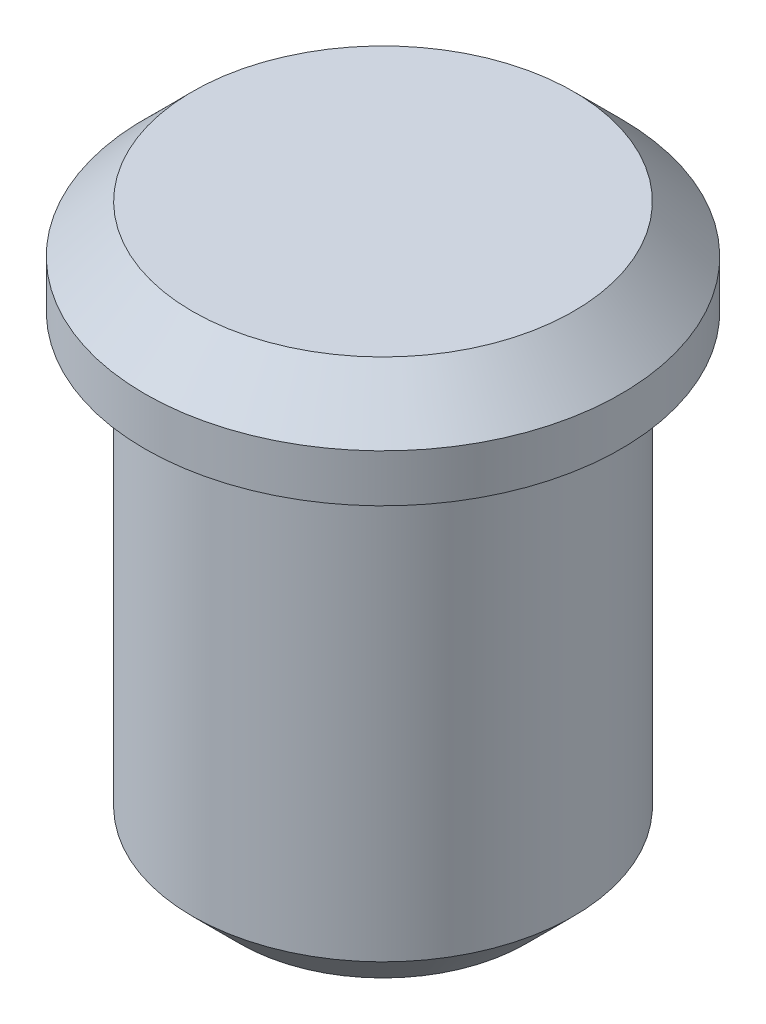
ISO-10303-21;
HEADER;
FILE_DESCRIPTION(('STEP AP214'),'2;1');
FILE_NAME('part.step','',(''),(''),'','','');
FILE_SCHEMA(('AUTOMOTIVE_DESIGN { 1 0 10303 214 1 1 1 1 }'));
ENDSEC;
DATA;
#1=APPLICATION_CONTEXT('core data for automotive mechanical design processes');
#2=APPLICATION_PROTOCOL_DEFINITION('international standard','automotive_design',2000,#1);
#3=PRODUCT_CONTEXT('',#1,'mechanical');
#4=PRODUCT('Part','Part','',(#3));
#5=PRODUCT_RELATED_PRODUCT_CATEGORY('part','',(#4));
#6=PRODUCT_DEFINITION_FORMATION('','',#4);
#7=PRODUCT_DEFINITION_CONTEXT('part definition',#1,'design');
#8=PRODUCT_DEFINITION('design','',#6,#7);
#9=PRODUCT_DEFINITION_SHAPE('','',#8);
#10=(LENGTH_UNIT() NAMED_UNIT(*) SI_UNIT(.MILLI.,.METRE.));
#11=(NAMED_UNIT(*) PLANE_ANGLE_UNIT() SI_UNIT($,.RADIAN.));
#12=(NAMED_UNIT(*) SI_UNIT($,.STERADIAN.) SOLID_ANGLE_UNIT());
#13=UNCERTAINTY_MEASURE_WITH_UNIT(LENGTH_MEASURE(1.E-05),#10,'distance_accuracy_value','');
#14=(GEOMETRIC_REPRESENTATION_CONTEXT(3) GLOBAL_UNCERTAINTY_ASSIGNED_CONTEXT((#13)) GLOBAL_UNIT_ASSIGNED_CONTEXT((#10,
#11,#12)) REPRESENTATION_CONTEXT('',''));
#15=CARTESIAN_POINT('',(0.,0.,0.));
#16=DIRECTION('',(0.,0.,1.));
#17=DIRECTION('',(1.,0.,0.));
#18=AXIS2_PLACEMENT_3D('',#15,#16,#17);
#19=CARTESIAN_POINT('',(0.,-10.,0.));
#20=DIRECTION('',(0.,1.,0.));
#21=DIRECTION('',(0.,0.,1.));
#22=AXIS2_PLACEMENT_3D('',#19,#20,#21);
#23=CYLINDRICAL_SURFACE('',#22,4.);
#24=CARTESIAN_POINT('',(0.,-9.,0.));
#25=DIRECTION('',(0.,1.,0.));
#26=DIRECTION('',(0.,0.,1.));
#27=AXIS2_PLACEMENT_3D('',#24,#25,#26);
#28=CIRCLE('',#27,4.);
#29=CARTESIAN_POINT('',(0.,-9.,4.));
#30=VERTEX_POINT('',#29);
#31=EDGE_CURVE('E45',#30,#30,#28,.T.);
#32=ORIENTED_EDGE('',*,*,#31,.T.);
#33=EDGE_LOOP('',(#32));
#34=FACE_BOUND('',#33,.T.);
#35=CARTESIAN_POINT('',(0.,0.,0.));
#36=DIRECTION('',(0.,1.,0.));
#37=DIRECTION('',(0.,0.,1.));
#38=AXIS2_PLACEMENT_3D('',#35,#36,#37);
#39=CIRCLE('',#38,4.);
#40=CARTESIAN_POINT('',(0.,0.,4.));
#41=VERTEX_POINT('',#40);
#42=EDGE_CURVE('E50',#41,#41,#39,.T.);
#43=ORIENTED_EDGE('',*,*,#42,.F.);
#44=EDGE_LOOP('',(#43));
#45=FACE_BOUND('',#44,.T.);
#46=ADVANCED_FACE('F30',(#34,#45),#23,.T.);
#47=CARTESIAN_POINT('',(0.,-10.,0.));
#48=DIRECTION('',(0.,1.,0.));
#49=DIRECTION('',(0.,0.,1.));
#50=AXIS2_PLACEMENT_3D('',#47,#48,#49);
#51=PLANE('',#50);
#52=CARTESIAN_POINT('',(0.,-10.,0.));
#53=DIRECTION('',(0.,1.,0.));
#54=DIRECTION('',(0.,0.,1.));
#55=AXIS2_PLACEMENT_3D('',#52,#53,#54);
#56=CIRCLE('',#55,3.);
#57=CARTESIAN_POINT('',(0.,-10.,3.));
#58=VERTEX_POINT('',#57);
#59=EDGE_CURVE('E41',#58,#58,#56,.F.);
#60=ORIENTED_EDGE('',*,*,#59,.T.);
#61=EDGE_LOOP('',(#60));
#62=FACE_BOUND('',#61,.T.);
#63=ADVANCED_FACE('F73',(#62),#51,.F.);
#64=CARTESIAN_POINT('',(0.,2.,0.));
#65=DIRECTION('',(0.,-1.,0.));
#66=DIRECTION('',(0.,0.,-1.));
#67=AXIS2_PLACEMENT_3D('',#64,#65,#66);
#68=CYLINDRICAL_SURFACE('',#67,5.);
#69=CARTESIAN_POINT('',(0.,1.,0.));
#70=DIRECTION('',(0.,1.,0.));
#71=DIRECTION('',(0.,0.,1.));
#72=AXIS2_PLACEMENT_3D('',#69,#70,#71);
#73=CIRCLE('',#72,5.);
#74=CARTESIAN_POINT('',(0.,1.,5.));
#75=VERTEX_POINT('',#74);
#76=EDGE_CURVE('E10',#75,#75,#73,.F.);
#77=ORIENTED_EDGE('',*,*,#76,.T.);
#78=EDGE_LOOP('',(#77));
#79=FACE_BOUND('',#78,.T.);
#80=CARTESIAN_POINT('',(0.,0.,0.));
#81=DIRECTION('',(0.,1.,0.));
#82=DIRECTION('',(0.,0.,1.));
#83=AXIS2_PLACEMENT_3D('',#80,#81,#82);
#84=CIRCLE('',#83,5.);
#85=CARTESIAN_POINT('',(0.,0.,5.));
#86=VERTEX_POINT('',#85);
#87=EDGE_CURVE('E53',#86,#86,#84,.T.);
#88=ORIENTED_EDGE('',*,*,#87,.T.);
#89=EDGE_LOOP('',(#88));
#90=FACE_BOUND('',#89,.T.);
#91=ADVANCED_FACE('F57',(#79,#90),#68,.T.);
#92=CARTESIAN_POINT('',(0.,2.,0.));
#93=DIRECTION('',(0.,1.,0.));
#94=DIRECTION('',(0.,0.,1.));
#95=AXIS2_PLACEMENT_3D('',#92,#93,#94);
#96=PLANE('',#95);
#97=CARTESIAN_POINT('',(0.,2.,0.));
#98=DIRECTION('',(0.,1.,0.));
#99=DIRECTION('',(0.,0.,1.));
#100=AXIS2_PLACEMENT_3D('',#97,#98,#99);
#101=CIRCLE('',#100,4.);
#102=CARTESIAN_POINT('',(0.,2.,4.));
#103=VERTEX_POINT('',#102);
#104=EDGE_CURVE('E37',#103,#103,#101,.T.);
#105=ORIENTED_EDGE('',*,*,#104,.T.);
#106=EDGE_LOOP('',(#105));
#107=FACE_BOUND('',#106,.T.);
#108=ADVANCED_FACE('F62',(#107),#96,.T.);
#109=CARTESIAN_POINT('',(0.,0.,0.));
#110=DIRECTION('',(0.,1.,0.));
#111=DIRECTION('',(0.,0.,1.));
#112=AXIS2_PLACEMENT_3D('',#109,#110,#111);
#113=PLANE('',#112);
#114=ORIENTED_EDGE('',*,*,#42,.T.);
#115=EDGE_LOOP('',(#114));
#116=FACE_BOUND('',#115,.T.);
#117=ORIENTED_EDGE('',*,*,#87,.F.);
#118=EDGE_LOOP('',(#117));
#119=FACE_BOUND('',#118,.T.);
#120=ADVANCED_FACE('F59',(#116,#119),#113,.F.);
#121=CARTESIAN_POINT('',(0.,-9.,0.));
#122=DIRECTION('',(0.,1.,0.));
#123=DIRECTION('',(0.,0.,1.));
#124=AXIS2_PLACEMENT_3D('',#121,#122,#123);
#125=CONICAL_SURFACE('',#124,4.,0.78539816339745);
#126=ORIENTED_EDGE('',*,*,#59,.F.);
#127=EDGE_LOOP('',(#126));
#128=FACE_BOUND('',#127,.T.);
#129=ORIENTED_EDGE('',*,*,#31,.F.);
#130=EDGE_LOOP('',(#129));
#131=FACE_BOUND('',#130,.T.);
#132=ADVANCED_FACE('F61',(#128,#131),#125,.T.);
#133=CARTESIAN_POINT('',(0.,2.,0.));
#134=DIRECTION('',(0.,-1.,0.));
#135=DIRECTION('',(0.,0.,-1.));
#136=AXIS2_PLACEMENT_3D('',#133,#134,#135);
#137=CONICAL_SURFACE('',#136,4.,0.78539816339745);
#138=ORIENTED_EDGE('',*,*,#76,.F.);
#139=EDGE_LOOP('',(#138));
#140=FACE_BOUND('',#139,.T.);
#141=ORIENTED_EDGE('',*,*,#104,.F.);
#142=EDGE_LOOP('',(#141));
#143=FACE_BOUND('',#142,.T.);
#144=ADVANCED_FACE('F32',(#140,#143),#137,.T.);
#145=CLOSED_SHELL('',(#46,#63,#91,#108,#120,#132,#144));
#146=MANIFOLD_SOLID_BREP('B2',#145);
#147=ADVANCED_BREP_SHAPE_REPRESENTATION('',(#18,#146),#14);
#148=SHAPE_DEFINITION_REPRESENTATION(#9,#147);
ENDSEC;
END-ISO-10303-21;
